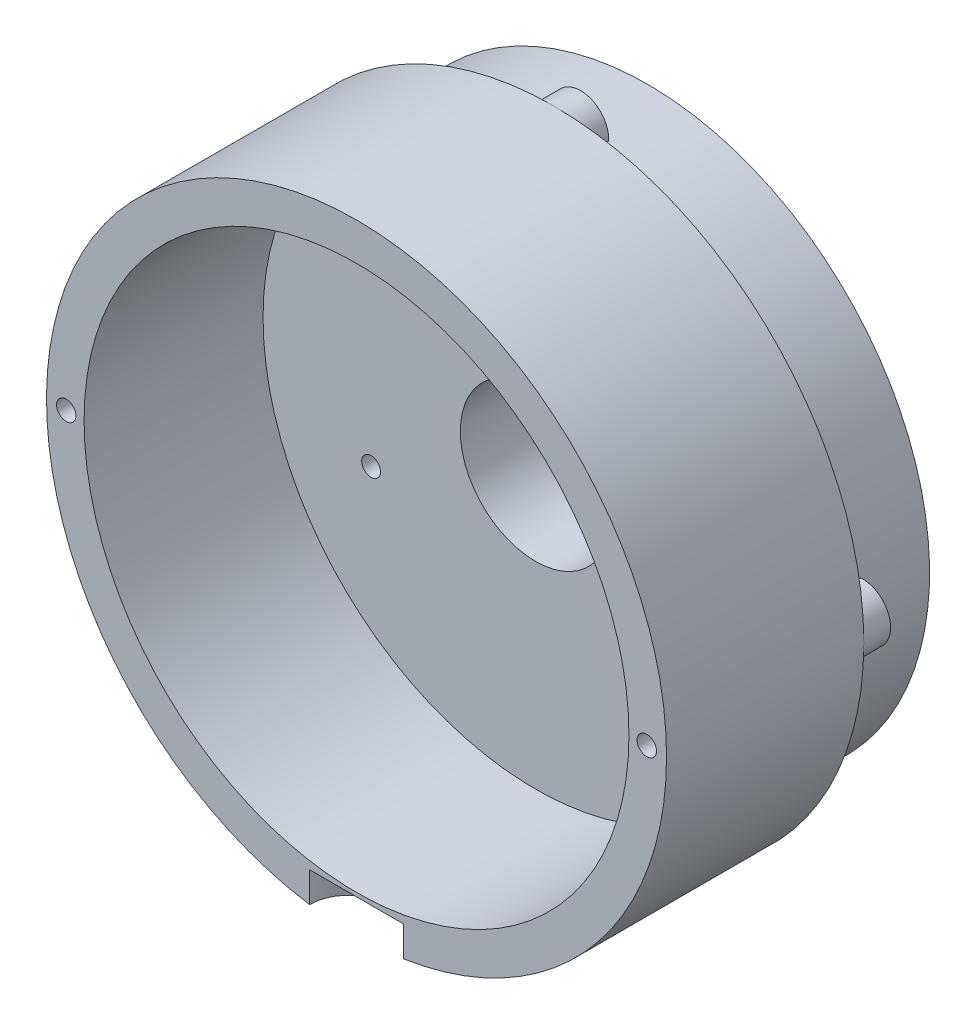
ISO-10303-21;
HEADER;
FILE_DESCRIPTION(('STEP AP214'),'2;1');
FILE_NAME('part.step','',(''),(''),'','','');
FILE_SCHEMA(('AUTOMOTIVE_DESIGN { 1 0 10303 214 1 1 1 1 }'));
ENDSEC;
DATA;
#1=APPLICATION_CONTEXT('core data for automotive mechanical design processes');
#2=APPLICATION_PROTOCOL_DEFINITION('international standard','automotive_design',2000,#1);
#3=PRODUCT_CONTEXT('',#1,'mechanical');
#4=PRODUCT('Part','Part','',(#3));
#5=PRODUCT_RELATED_PRODUCT_CATEGORY('part','',(#4));
#6=PRODUCT_DEFINITION_FORMATION('','',#4);
#7=PRODUCT_DEFINITION_CONTEXT('part definition',#1,'design');
#8=PRODUCT_DEFINITION('design','',#6,#7);
#9=PRODUCT_DEFINITION_SHAPE('','',#8);
#10=(LENGTH_UNIT() NAMED_UNIT(*) SI_UNIT(.MILLI.,.METRE.));
#11=(NAMED_UNIT(*) PLANE_ANGLE_UNIT() SI_UNIT($,.RADIAN.));
#12=(NAMED_UNIT(*) SI_UNIT($,.STERADIAN.) SOLID_ANGLE_UNIT());
#13=UNCERTAINTY_MEASURE_WITH_UNIT(LENGTH_MEASURE(1.E-05),#10,'distance_accuracy_value','');
#14=(GEOMETRIC_REPRESENTATION_CONTEXT(3) GLOBAL_UNCERTAINTY_ASSIGNED_CONTEXT((#13)) GLOBAL_UNIT_ASSIGNED_CONTEXT((#10,
#11,#12)) REPRESENTATION_CONTEXT('',''));
#15=CARTESIAN_POINT('',(0.,0.,0.));
#16=DIRECTION('',(0.,0.,1.));
#17=DIRECTION('',(1.,0.,0.));
#18=AXIS2_PLACEMENT_3D('',#15,#16,#17);
#19=CARTESIAN_POINT('',(0.,0.,-31.));
#20=DIRECTION('',(0.,0.,1.));
#21=DIRECTION('',(1.,0.,0.));
#22=AXIS2_PLACEMENT_3D('',#19,#20,#21);
#23=CYLINDRICAL_SURFACE('',#22,30.);
#24=CARTESIAN_POINT('',(0.,0.,-31.));
#25=DIRECTION('',(0.,0.,-1.));
#26=DIRECTION('',(-1.,0.,0.));
#27=AXIS2_PLACEMENT_3D('',#24,#25,#26);
#28=CIRCLE('',#27,30.);
#29=CARTESIAN_POINT('',(-30.,0.,-31.));
#30=VERTEX_POINT('',#29);
#31=EDGE_CURVE('E666',#30,#30,#28,.T.);
#32=ORIENTED_EDGE('',*,*,#31,.F.);
#33=EDGE_LOOP('',(#32));
#34=FACE_BOUND('',#33,.T.);
#35=DIRECTION('',(0.,0.,1.));
#36=VECTOR('',#35,1.);
#37=CARTESIAN_POINT('',(2.99624765331606,-29.85,-23.85));
#38=LINE('',#37,#36);
#39=CARTESIAN_POINT('',(2.99624765331606,-29.85,-23.85));
#40=VERTEX_POINT('',#39);
#41=CARTESIAN_POINT('',(2.99624765331608,-29.85,-21.));
#42=VERTEX_POINT('',#41);
#43=EDGE_CURVE('E608',#40,#42,#38,.T.);
#44=ORIENTED_EDGE('',*,*,#43,.F.);
#45=CARTESIAN_POINT('',(0.,0.,-23.85));
#46=DIRECTION('',(0.,0.,1.));
#47=DIRECTION('',(-1.,0.,0.));
#48=AXIS2_PLACEMENT_3D('',#45,#46,#47);
#49=CIRCLE('',#48,30.);
#50=CARTESIAN_POINT('',(-2.99624765331544,-29.85,-23.85));
#51=VERTEX_POINT('',#50);
#52=EDGE_CURVE('E62',#51,#40,#49,.T.);
#53=ORIENTED_EDGE('',*,*,#52,.F.);
#54=DIRECTION('',(0.,0.,1.));
#55=VECTOR('',#54,1.);
#56=CARTESIAN_POINT('',(-2.99624765331544,-29.85,-23.85));
#57=LINE('',#56,#55);
#58=CARTESIAN_POINT('',(-2.99624765331546,-29.85,-21.));
#59=VERTEX_POINT('',#58);
#60=EDGE_CURVE('E618',#51,#59,#57,.T.);
#61=ORIENTED_EDGE('',*,*,#60,.T.);
#62=CARTESIAN_POINT('',(0.,0.,-21.));
#63=DIRECTION('',(0.,0.,-1.));
#64=DIRECTION('',(-1.,0.,0.));
#65=AXIS2_PLACEMENT_3D('',#62,#63,#64);
#66=CIRCLE('',#65,30.);
#67=CARTESIAN_POINT('',(-29.85,-2.99624765331598,-21.));
#68=VERTEX_POINT('',#67);
#69=EDGE_CURVE('E602',#59,#68,#66,.T.);
#70=ORIENTED_EDGE('',*,*,#69,.T.);
#71=DIRECTION('',(0.,0.,1.));
#72=VECTOR('',#71,1.);
#73=CARTESIAN_POINT('',(-29.85,-2.99624765331596,-23.85));
#74=LINE('',#73,#72);
#75=CARTESIAN_POINT('',(-29.85,-2.99624765331596,-23.85));
#76=VERTEX_POINT('',#75);
#77=EDGE_CURVE('E612',#76,#68,#74,.T.);
#78=ORIENTED_EDGE('',*,*,#77,.F.);
#79=CARTESIAN_POINT('',(0.,0.,-23.85));
#80=DIRECTION('',(0.,0.,1.));
#81=DIRECTION('',(-1.,0.,0.));
#82=AXIS2_PLACEMENT_3D('',#79,#80,#81);
#83=CIRCLE('',#82,30.);
#84=CARTESIAN_POINT('',(-29.85,2.99624765331554,-23.85));
#85=VERTEX_POINT('',#84);
#86=EDGE_CURVE('E633',#85,#76,#83,.T.);
#87=ORIENTED_EDGE('',*,*,#86,.F.);
#88=DIRECTION('',(0.,0.,1.));
#89=VECTOR('',#88,1.);
#90=CARTESIAN_POINT('',(-29.85,2.99624765331554,-23.85));
#91=LINE('',#90,#89);
#92=CARTESIAN_POINT('',(-29.85,2.99624765331554,-21.));
#93=VERTEX_POINT('',#92);
#94=EDGE_CURVE('E614',#85,#93,#91,.T.);
#95=ORIENTED_EDGE('',*,*,#94,.T.);
#96=CARTESIAN_POINT('',(-2.99624765331587,29.85,-21.));
#97=VERTEX_POINT('',#96);
#98=EDGE_CURVE('E688',#93,#97,#66,.T.);
#99=ORIENTED_EDGE('',*,*,#98,.T.);
#100=DIRECTION('',(0.,0.,1.));
#101=VECTOR('',#100,1.);
#102=CARTESIAN_POINT('',(-2.99624765331585,29.85,-23.85));
#103=LINE('',#102,#101);
#104=CARTESIAN_POINT('',(-2.99624765331585,29.85,-23.85));
#105=VERTEX_POINT('',#104);
#106=EDGE_CURVE('E629',#105,#97,#103,.T.);
#107=ORIENTED_EDGE('',*,*,#106,.F.);
#108=CARTESIAN_POINT('',(0.,0.,-23.85));
#109=DIRECTION('',(0.,0.,1.));
#110=DIRECTION('',(-1.,0.,0.));
#111=AXIS2_PLACEMENT_3D('',#108,#109,#110);
#112=CIRCLE('',#111,30.);
#113=CARTESIAN_POINT('',(2.99624765331564,29.85,-23.85));
#114=VERTEX_POINT('',#113);
#115=EDGE_CURVE('E646',#114,#105,#112,.T.);
#116=ORIENTED_EDGE('',*,*,#115,.F.);
#117=DIRECTION('',(0.,0.,1.));
#118=VECTOR('',#117,1.);
#119=CARTESIAN_POINT('',(2.99624765331565,29.85,-23.85));
#120=LINE('',#119,#118);
#121=CARTESIAN_POINT('',(2.99624765331565,29.85,-21.));
#122=VERTEX_POINT('',#121);
#123=EDGE_CURVE('E638',#114,#122,#120,.T.);
#124=ORIENTED_EDGE('',*,*,#123,.T.);
#125=CARTESIAN_POINT('',(29.85,2.99624765331575,-21.));
#126=VERTEX_POINT('',#125);
#127=EDGE_CURVE('E671',#122,#126,#66,.T.);
#128=ORIENTED_EDGE('',*,*,#127,.T.);
#129=DIRECTION('',(0.,0.,1.));
#130=VECTOR('',#129,1.);
#131=CARTESIAN_POINT('',(29.85,2.99624765331575,-23.85));
#132=LINE('',#131,#130);
#133=CARTESIAN_POINT('',(29.85,2.99624765331575,-23.85));
#134=VERTEX_POINT('',#133);
#135=EDGE_CURVE('E663',#134,#126,#132,.T.);
#136=ORIENTED_EDGE('',*,*,#135,.F.);
#137=CARTESIAN_POINT('',(0.,0.,-23.85));
#138=DIRECTION('',(0.,0.,1.));
#139=DIRECTION('',(-1.,0.,0.));
#140=AXIS2_PLACEMENT_3D('',#137,#138,#139);
#141=CIRCLE('',#140,30.);
#142=CARTESIAN_POINT('',(29.85,-2.99624765331575,-23.85));
#143=VERTEX_POINT('',#142);
#144=EDGE_CURVE('E651',#143,#134,#141,.T.);
#145=ORIENTED_EDGE('',*,*,#144,.F.);
#146=DIRECTION('',(0.,0.,1.));
#147=VECTOR('',#146,1.);
#148=CARTESIAN_POINT('',(29.85,-2.99624765331575,-23.85));
#149=LINE('',#148,#147);
#150=CARTESIAN_POINT('',(29.85,-2.99624765331575,-21.));
#151=VERTEX_POINT('',#150);
#152=EDGE_CURVE('E658',#143,#151,#149,.T.);
#153=ORIENTED_EDGE('',*,*,#152,.T.);
#154=EDGE_CURVE('E48',#151,#42,#66,.T.);
#155=ORIENTED_EDGE('',*,*,#154,.T.);
#156=EDGE_LOOP('',(#44,#53,#61,#70,#78,#87,#95,#99,#107,#116,#124,#128,#136,#145,#153,#155));
#157=FACE_BOUND('',#156,.T.);
#158=ADVANCED_FACE('F39',(#34,#157),#23,.T.);
#159=CARTESIAN_POINT('',(0.,0.,-21.));
#160=DIRECTION('',(0.,0.,1.));
#161=DIRECTION('',(1.,0.,0.));
#162=AXIS2_PLACEMENT_3D('',#159,#160,#161);
#163=PLANE('',#162);
#164=CARTESIAN_POINT('',(3.14233320495882E-13,-30.,-21.));
#165=DIRECTION('',(0.,0.,-1.));
#166=DIRECTION('',(-1.,0.,0.));
#167=AXIS2_PLACEMENT_3D('',#164,#165,#166);
#168=CIRCLE('',#167,3.00000000000002);
#169=CARTESIAN_POINT('',(3.4565665254547E-13,-33.,-21.));
#170=VERTEX_POINT('',#169);
#171=EDGE_CURVE('E597',#170,#59,#168,.T.);
#172=ORIENTED_EDGE('',*,*,#171,.F.);
#173=CARTESIAN_POINT('',(0.,0.,-21.));
#174=DIRECTION('',(0.,0.,1.));
#175=DIRECTION('',(1.,0.,0.));
#176=AXIS2_PLACEMENT_3D('',#173,#174,#175);
#177=CIRCLE('',#176,33.);
#178=CARTESIAN_POINT('',(-33.,-2.30437768363647E-13,-21.));
#179=VERTEX_POINT('',#178);
#180=EDGE_CURVE('E600',#179,#170,#177,.T.);
#181=ORIENTED_EDGE('',*,*,#180,.F.);
#182=CARTESIAN_POINT('',(-30.,-2.09488880330588E-13,-21.));
#183=DIRECTION('',(0.,0.,-1.));
#184=DIRECTION('',(-1.,0.,0.));
#185=AXIS2_PLACEMENT_3D('',#182,#183,#184);
#186=CIRCLE('',#185,3.00000000000002);
#187=EDGE_CURVE('E626',#68,#179,#186,.T.);
#188=ORIENTED_EDGE('',*,*,#187,.F.);
#189=ORIENTED_EDGE('',*,*,#69,.F.);
#190=EDGE_LOOP('',(#172,#181,#188,#189));
#191=FACE_BOUND('',#190,.T.);
#192=ADVANCED_FACE('F234',(#191),#163,.F.);
#193=EDGE_CURVE('E604',#42,#170,#168,.T.);
#194=ORIENTED_EDGE('',*,*,#193,.F.);
#195=ORIENTED_EDGE('',*,*,#154,.F.);
#196=CARTESIAN_POINT('',(30.,0.,-21.));
#197=DIRECTION('',(0.,0.,-1.));
#198=DIRECTION('',(-1.,0.,0.));
#199=AXIS2_PLACEMENT_3D('',#196,#197,#198);
#200=CIRCLE('',#199,3.00000000000002);
#201=CARTESIAN_POINT('',(33.,0.,-21.));
#202=VERTEX_POINT('',#201);
#203=EDGE_CURVE('E645',#202,#151,#200,.T.);
#204=ORIENTED_EDGE('',*,*,#203,.F.);
#205=EDGE_CURVE('E680',#170,#202,#177,.T.);
#206=ORIENTED_EDGE('',*,*,#205,.F.);
#207=EDGE_LOOP('',(#194,#195,#204,#206));
#208=FACE_BOUND('',#207,.T.);
#209=ADVANCED_FACE('F436',(#208),#163,.F.);
#210=EDGE_CURVE('E630',#179,#93,#186,.T.);
#211=ORIENTED_EDGE('',*,*,#210,.F.);
#212=CARTESIAN_POINT('',(-1.15218884181823E-13,33.,-21.));
#213=VERTEX_POINT('',#212);
#214=EDGE_CURVE('E679',#213,#179,#177,.T.);
#215=ORIENTED_EDGE('',*,*,#214,.F.);
#216=CARTESIAN_POINT('',(-1.04744440165294E-13,30.,-21.));
#217=DIRECTION('',(0.,0.,-1.));
#218=DIRECTION('',(-1.,0.,0.));
#219=AXIS2_PLACEMENT_3D('',#216,#217,#218);
#220=CIRCLE('',#219,3.00000000000002);
#221=EDGE_CURVE('E642',#97,#213,#220,.T.);
#222=ORIENTED_EDGE('',*,*,#221,.F.);
#223=ORIENTED_EDGE('',*,*,#98,.F.);
#224=EDGE_LOOP('',(#211,#215,#222,#223));
#225=FACE_BOUND('',#224,.T.);
#226=ADVANCED_FACE('F246',(#225),#163,.F.);
#227=CARTESIAN_POINT('',(0.,0.,-21.));
#228=DIRECTION('',(0.,0.,1.));
#229=DIRECTION('',(1.,0.,0.));
#230=AXIS2_PLACEMENT_3D('',#227,#228,#229);
#231=CYLINDRICAL_SURFACE('',#230,33.);
#232=CARTESIAN_POINT('',(-5.,-32.6190128606002,0.));
#233=CARTESIAN_POINT('',(-5.00001601020323,-32.6190035828036,-0.139767168316412));
#234=CARTESIAN_POINT('',(-4.99414023076228,-32.6199108647252,-0.279530949472853));
#235=CARTESIAN_POINT('',(-4.97072156401182,-32.6234913261665,-0.558042581063598));
#236=CARTESIAN_POINT('',(-4.95317973713174,-32.6261643451827,-0.696790522677648));
#237=CARTESIAN_POINT('',(-4.90657275631915,-32.6332049503196,-0.972125522905081));
#238=CARTESIAN_POINT('',(-4.87752114214626,-32.6375705452176,-1.10871492513022));
#239=CARTESIAN_POINT('',(-4.80811872926188,-32.6478671900791,-1.3789306045644));
#240=CARTESIAN_POINT('',(-4.76776796420062,-32.6537982353805,-1.51255689059668));
#241=CARTESIAN_POINT('',(-4.67606282638854,-32.6670564742613,-1.77591691938822));
#242=CARTESIAN_POINT('',(-4.6247076885632,-32.6743837649102,-1.90565039078581));
#243=CARTESIAN_POINT('',(-4.51135028346583,-32.6902277977168,-2.16036052095221));
#244=CARTESIAN_POINT('',(-4.44934408241917,-32.698744979121,-2.28533540131443));
#245=CARTESIAN_POINT('',(-4.31516996042624,-32.7167217974423,-2.5295678786847));
#246=CARTESIAN_POINT('',(-4.2430061457105,-32.7261810530746,-2.6488277600038));
#247=CARTESIAN_POINT('',(-4.08897812396379,-32.7457827034096,-2.88091347560192));
#248=CARTESIAN_POINT('',(-4.00711031549556,-32.7559253511327,-2.99373689796603));
#249=CARTESIAN_POINT('',(-3.83367296649378,-32.7766781210404,-3.21288202284274));
#250=CARTESIAN_POINT('',(-3.74204096143706,-32.7872909637268,-3.31915403608859));
#251=CARTESIAN_POINT('',(-3.55014304390875,-32.8086239428629,-3.52365623710888));
#252=CARTESIAN_POINT('',(-3.44987394858321,-32.8193441175683,-3.62188343405101));
#253=CARTESIAN_POINT('',(-3.2414455563156,-32.8405846311388,-3.8095527181624));
#254=CARTESIAN_POINT('',(-3.1332879539488,-32.8511050123144,-3.89899668247809));
#255=CARTESIAN_POINT('',(-2.90976710785706,-32.8716572966495,-4.06853025645773));
#256=CARTESIAN_POINT('',(-2.79440122137656,-32.8816890182256,-4.14861640403586));
#257=CARTESIAN_POINT('',(-2.55675833739258,-32.9010221727794,-4.29916980162759));
#258=CARTESIAN_POINT('',(-2.43445239953123,-32.9103200916287,-4.36959183382518));
#259=CARTESIAN_POINT('',(-2.18422022475594,-32.9278744704263,-4.49989874865233));
#260=CARTESIAN_POINT('',(-2.05629191441459,-32.9361305417408,-4.55977970248045));
#261=CARTESIAN_POINT('',(-1.79582286413044,-32.951358496512,-4.66850354734549));
#262=CARTESIAN_POINT('',(-1.66328431859749,-32.958330981257,-4.71735160911933));
#263=CARTESIAN_POINT('',(-1.3944407885997,-32.970800039678,-4.80369440352828));
#264=CARTESIAN_POINT('',(-1.25813444947012,-32.9762960746975,-4.8411849932257));
#265=CARTESIAN_POINT('',(-0.983870528206103,-32.9856127463921,-4.90424548517488));
#266=CARTESIAN_POINT('',(-0.84593486765723,-32.989446429551,-4.92990831817986));
#267=CARTESIAN_POINT('',(-0.568364258929378,-32.9953984822913,-4.96957439633096));
#268=CARTESIAN_POINT('',(-0.428728737246001,-32.997516255704,-4.98357358915809));
#269=CARTESIAN_POINT('',(-0.0087803796854928,-33.0011776878662,-5.00781969659953));
#270=CARTESIAN_POINT('',(0.272880925578491,-33.0000401146603,-5.00038548576204));
#271=CARTESIAN_POINT('',(0.689771801664072,-32.9930842248025,-4.95415987603519));
#272=CARTESIAN_POINT('',(0.827315033678111,-32.9899114811567,-4.93304435121594));
#273=CARTESIAN_POINT('',(1.10012451959802,-32.9819384006462,-4.87944650495612));
#274=CARTESIAN_POINT('',(1.235391547641,-32.9771386293769,-4.84696813339984));
#275=CARTESIAN_POINT('',(1.50272753510958,-32.9660392127504,-4.77086446561458));
#276=CARTESIAN_POINT('',(1.63479531686574,-32.9597390240496,-4.72723513088654));
#277=CARTESIAN_POINT('',(1.89473519646658,-32.9458177550404,-4.62917520434625));
#278=CARTESIAN_POINT('',(2.02260876673376,-32.9381971443128,-4.57474845141849));
#279=CARTESIAN_POINT('',(2.27385537618176,-32.9218089002243,-4.45522365410155));
#280=CARTESIAN_POINT('',(2.3972071010094,-32.9130365534308,-4.3900814639814));
#281=CARTESIAN_POINT('',(2.63794736518501,-32.8946166451339,-4.24978077474453));
#282=CARTESIAN_POINT('',(2.75533801853808,-32.8849693973306,-4.17462586124074));
#283=CARTESIAN_POINT('',(2.98344672487643,-32.8650598780903,-4.01477885898509));
#284=CARTESIAN_POINT('',(3.09416223120415,-32.854797374866,-3.93008316520545));
#285=CARTESIAN_POINT('',(3.30808169306138,-32.8339480290047,-3.75179634026021));
#286=CARTESIAN_POINT('',(3.41128831997988,-32.8233613036377,-3.65820840023055));
#287=CARTESIAN_POINT('',(3.61055424830731,-32.8020432897885,-3.46174447816719));
#288=CARTESIAN_POINT('',(3.70652905660725,-32.7913116348693,-3.35878281641981));
#289=CARTESIAN_POINT('',(3.8894386194533,-32.7701196724516,-3.14516022351662));
#290=CARTESIAN_POINT('',(3.97637665014609,-32.7596592676548,-3.03450210704915));
#291=CARTESIAN_POINT('',(4.14069611535747,-32.7392959127616,-2.80614252586511));
#292=CARTESIAN_POINT('',(4.21807114370907,-32.7293933387418,-2.68843641728553));
#293=CARTESIAN_POINT('',(4.36261657477498,-32.7104400831003,-2.44691150479264));
#294=CARTESIAN_POINT('',(4.42979081416874,-32.7013890816783,-2.32309502242059));
#295=CARTESIAN_POINT('',(4.55359149681402,-32.6843803354967,-2.06994974368347));
#296=CARTESIAN_POINT('',(4.61019899824366,-32.6764245606024,-1.94061154937197));
#297=CARTESIAN_POINT('',(4.71227813733427,-32.6618599291047,-1.67759519710639));
#298=CARTESIAN_POINT('',(4.75775405347049,-32.6552505551703,-1.54391872903271));
#299=CARTESIAN_POINT('',(4.83721185184773,-32.6435750795525,-1.27328365891392));
#300=CARTESIAN_POINT('',(4.87120590986088,-32.6385073436315,-1.13632869964392));
#301=CARTESIAN_POINT('',(4.92749352054901,-32.6300569846447,-0.860040374803553));
#302=CARTESIAN_POINT('',(4.94979270871416,-32.6266735499927,-0.72070818824858));
#303=CARTESIAN_POINT('',(4.97744045804998,-32.6224649007544,-0.484266938509058));
#304=CARTESIAN_POINT('',(4.98590498972544,-32.621171163183,-0.387519128260159));
#305=CARTESIAN_POINT('',(4.99718116376625,-32.6194449519462,-0.193850687134879));
#306=CARTESIAN_POINT('',(5.0000023087137,-32.6190110304963,-0.0969306222827842));
#307=CARTESIAN_POINT('',(5.,-32.6190128606002,0.));
#308=B_SPLINE_CURVE_WITH_KNOTS('',3,(#232,#233,#234,#235,#236,#237,#238,#239,#240,#241,#242,
#243,#244,#245,#246,#247,#248,#249,#250,#251,#252,#253,#254,#255,#256,#257,#258,#259,#260,#261,
#262,#263,#264,#265,#266,#267,#268,#269,#270,#271,#272,#273,#274,#275,#276,#277,#278,#279,#280,
#281,#282,#283,#284,#285,#286,#287,#288,#289,#290,#291,#292,#293,#294,#295,#296,#297,#298,#299,
#300,#301,#302,#303,#304,#305,#306,#307),.UNSPECIFIED.,.F.,.F.,(4,2,2,2,2,2,2,2,2,2,2,2,2,2,2,2,
2,2,2,2,2,2,2,2,2,2,2,2,2,2,2,2,2,2,2,2,2,4),(0.,0.419170102117368,0.838302107392148,
1.25694251574136,1.67558167734276,2.09424995411039,2.5130731920964,2.93172760383453,
3.35053787989946,3.77220964196175,4.19403746454652,4.6157749372695,5.03766794830537,
5.46147216609385,5.88543400849631,6.30919674035698,6.73311386524237,7.15364097676925,
7.57431413191477,8.41472750218509,8.83193072486811,9.24898906574129,9.66619866550322,
10.0832601966901,10.5020850821021,10.9207603850855,11.3395944204925,11.7582787137323,
12.181272134873,12.6041116673557,13.0272329382704,13.4501946702459,13.8739074668372,
14.2974571508726,14.7205562671155,15.1434513138091,15.4346711109229,15.7254001252013),.UNSPECIFIED.);
#309=CARTESIAN_POINT('',(-5.,-32.6190128606002,0.));
#310=VERTEX_POINT('',#309);
#311=CARTESIAN_POINT('',(5.,-32.6190128606002,0.));
#312=VERTEX_POINT('',#311);
#313=EDGE_CURVE('E145',#310,#312,#308,.T.);
#314=ORIENTED_EDGE('',*,*,#313,.F.);
#315=CARTESIAN_POINT('',(0.,0.,0.));
#316=DIRECTION('',(0.,0.,1.));
#317=DIRECTION('',(1.,0.,0.));
#318=AXIS2_PLACEMENT_3D('',#315,#316,#317);
#319=CIRCLE('',#318,33.);
#320=EDGE_CURVE('E144',#312,#310,#319,.T.);
#321=ORIENTED_EDGE('',*,*,#320,.F.);
#322=EDGE_LOOP('',(#314,#321));
#323=FACE_BOUND('',#322,.T.);
#324=EDGE_CURVE('E677',#202,#213,#177,.T.);
#325=ORIENTED_EDGE('',*,*,#324,.T.);
#326=ORIENTED_EDGE('',*,*,#214,.T.);
#327=ORIENTED_EDGE('',*,*,#180,.T.);
#328=ORIENTED_EDGE('',*,*,#205,.T.);
#329=EDGE_LOOP('',(#325,#326,#327,#328));
#330=FACE_BOUND('',#329,.T.);
#331=ADVANCED_FACE('F41',(#323,#330),#231,.T.);
#332=CARTESIAN_POINT('',(-1.04744440165294E-13,30.,-21.));
#333=DIRECTION('',(0.,0.,1.));
#334=DIRECTION('',(1.,0.,0.));
#335=AXIS2_PLACEMENT_3D('',#332,#333,#334);
#336=CIRCLE('',#335,3.00000000000002);
#337=EDGE_CURVE('E11',#213,#122,#336,.F.);
#338=ORIENTED_EDGE('',*,*,#337,.F.);
#339=ORIENTED_EDGE('',*,*,#324,.F.);
#340=EDGE_CURVE('E655',#126,#202,#200,.T.);
#341=ORIENTED_EDGE('',*,*,#340,.F.);
#342=ORIENTED_EDGE('',*,*,#127,.F.);
#343=EDGE_LOOP('',(#338,#339,#341,#342));
#344=FACE_BOUND('',#343,.T.);
#345=ADVANCED_FACE('F243',(#344),#163,.F.);
#346=CARTESIAN_POINT('',(0.,0.,0.));
#347=DIRECTION('',(0.,0.,1.));
#348=DIRECTION('',(1.,0.,0.));
#349=AXIS2_PLACEMENT_3D('',#346,#347,#348);
#350=PLANE('',#349);
#351=DIRECTION('',(0.,-1.,0.));
#352=VECTOR('',#351,1.);
#353=CARTESIAN_POINT('',(-5.,-29.4,0.));
#354=LINE('',#353,#352);
#355=CARTESIAN_POINT('',(-5.,-29.4,0.));
#356=VERTEX_POINT('',#355);
#357=EDGE_CURVE('E129',#356,#310,#354,.T.);
#358=ORIENTED_EDGE('',*,*,#357,.F.);
#359=DIRECTION('',(-1.,0.,0.));
#360=VECTOR('',#359,1.);
#361=CARTESIAN_POINT('',(5.,-29.4,0.));
#362=LINE('',#361,#360);
#363=CARTESIAN_POINT('',(5.,-29.4,0.));
#364=VERTEX_POINT('',#363);
#365=EDGE_CURVE('E134',#364,#356,#362,.T.);
#366=ORIENTED_EDGE('',*,*,#365,.F.);
#367=DIRECTION('',(0.,-1.,0.));
#368=VECTOR('',#367,1.);
#369=CARTESIAN_POINT('',(5.,-29.4,0.));
#370=LINE('',#369,#368);
#371=EDGE_CURVE('E132',#364,#312,#370,.T.);
#372=ORIENTED_EDGE('',*,*,#371,.T.);
#373=ORIENTED_EDGE('',*,*,#320,.T.);
#374=EDGE_LOOP('',(#358,#366,#372,#373));
#375=FACE_BOUND('',#374,.T.);
#376=CARTESIAN_POINT('',(-30.9,0.,0.));
#377=DIRECTION('',(0.,0.,1.));
#378=DIRECTION('',(1.,0.,0.));
#379=AXIS2_PLACEMENT_3D('',#376,#377,#378);
#380=CIRCLE('',#379,1.0325);
#381=CARTESIAN_POINT('',(-29.8675,0.,0.));
#382=VERTEX_POINT('',#381);
#383=EDGE_CURVE('E718',#382,#382,#380,.T.);
#384=ORIENTED_EDGE('',*,*,#383,.F.);
#385=EDGE_LOOP('',(#384));
#386=FACE_BOUND('',#385,.T.);
#387=CARTESIAN_POINT('',(30.9,0.,0.));
#388=DIRECTION('',(0.,0.,1.));
#389=DIRECTION('',(-1.,0.,0.));
#390=AXIS2_PLACEMENT_3D('',#387,#388,#389);
#391=CIRCLE('',#390,1.0325);
#392=CARTESIAN_POINT('',(29.8675,0.,0.));
#393=VERTEX_POINT('',#392);
#394=EDGE_CURVE('E716',#393,#393,#391,.T.);
#395=ORIENTED_EDGE('',*,*,#394,.F.);
#396=EDGE_LOOP('',(#395));
#397=FACE_BOUND('',#396,.T.);
#398=CARTESIAN_POINT('',(0.,0.,0.));
#399=DIRECTION('',(0.,0.,1.));
#400=DIRECTION('',(1.,0.,0.));
#401=AXIS2_PLACEMENT_3D('',#398,#399,#400);
#402=CIRCLE('',#401,29.);
#403=CARTESIAN_POINT('',(29.,0.,0.));
#404=VERTEX_POINT('',#403);
#405=EDGE_CURVE('E669',#404,#404,#402,.T.);
#406=ORIENTED_EDGE('',*,*,#405,.F.);
#407=EDGE_LOOP('',(#406));
#408=FACE_BOUND('',#407,.T.);
#409=ADVANCED_FACE('F141',(#375,#386,#397,#408),#350,.T.);
#410=CARTESIAN_POINT('',(0.,0.,-19.05));
#411=DIRECTION('',(0.,0.,1.));
#412=DIRECTION('',(1.,0.,0.));
#413=AXIS2_PLACEMENT_3D('',#410,#411,#412);
#414=CYLINDRICAL_SURFACE('',#413,29.);
#415=CARTESIAN_POINT('',(0.,0.,-19.05));
#416=DIRECTION('',(0.,0.,1.));
#417=DIRECTION('',(1.,0.,0.));
#418=AXIS2_PLACEMENT_3D('',#415,#416,#417);
#419=CIRCLE('',#418,29.);
#420=CARTESIAN_POINT('',(29.,0.,-19.05));
#421=VERTEX_POINT('',#420);
#422=EDGE_CURVE('E672',#421,#421,#419,.T.);
#423=ORIENTED_EDGE('',*,*,#422,.F.);
#424=EDGE_LOOP('',(#423));
#425=FACE_BOUND('',#424,.T.);
#426=ORIENTED_EDGE('',*,*,#405,.T.);
#427=EDGE_LOOP('',(#426));
#428=FACE_BOUND('',#427,.T.);
#429=ADVANCED_FACE('F238',(#425,#428),#414,.F.);
#430=CARTESIAN_POINT('',(0.,0.,-19.05));
#431=DIRECTION('',(0.,0.,1.));
#432=DIRECTION('',(1.,0.,0.));
#433=AXIS2_PLACEMENT_3D('',#430,#431,#432);
#434=PLANE('',#433);
#435=CARTESIAN_POINT('',(17.5,-8.,-19.05));
#436=DIRECTION('',(0.,0.,1.));
#437=DIRECTION('',(1.,0.,0.));
#438=AXIS2_PLACEMENT_3D('',#435,#436,#437);
#439=CIRCLE('',#438,1.);
#440=CARTESIAN_POINT('',(18.5,-8.,-19.05));
#441=VERTEX_POINT('',#440);
#442=EDGE_CURVE('E750',#441,#441,#439,.T.);
#443=ORIENTED_EDGE('',*,*,#442,.F.);
#444=EDGE_LOOP('',(#443));
#445=FACE_BOUND('',#444,.T.);
#446=CARTESIAN_POINT('',(-17.5,-8.,-19.05));
#447=DIRECTION('',(0.,0.,1.));
#448=DIRECTION('',(-1.,0.,0.));
#449=AXIS2_PLACEMENT_3D('',#446,#447,#448);
#450=CIRCLE('',#449,1.);
#451=CARTESIAN_POINT('',(-18.5,-8.,-19.05));
#452=VERTEX_POINT('',#451);
#453=EDGE_CURVE('E753',#452,#452,#450,.T.);
#454=ORIENTED_EDGE('',*,*,#453,.F.);
#455=EDGE_LOOP('',(#454));
#456=FACE_BOUND('',#455,.T.);
#457=CARTESIAN_POINT('',(0.,15.,-19.05));
#458=DIRECTION('',(0.,0.,1.));
#459=DIRECTION('',(1.,0.,0.));
#460=AXIS2_PLACEMENT_3D('',#457,#458,#459);
#461=CIRCLE('',#460,4.1);
#462=CARTESIAN_POINT('',(4.1,15.,-19.05));
#463=VERTEX_POINT('',#462);
#464=EDGE_CURVE('E703',#463,#463,#461,.T.);
#465=ORIENTED_EDGE('',*,*,#464,.F.);
#466=EDGE_LOOP('',(#465));
#467=FACE_BOUND('',#466,.T.);
#468=CARTESIAN_POINT('',(0.,0.,-19.05));
#469=DIRECTION('',(0.,0.,1.));
#470=DIRECTION('',(1.,0.,0.));
#471=AXIS2_PLACEMENT_3D('',#468,#469,#470);
#472=CIRCLE('',#471,8.);
#473=CARTESIAN_POINT('',(8.,0.,-19.05));
#474=VERTEX_POINT('',#473);
#475=EDGE_CURVE('E695',#474,#474,#472,.T.);
#476=ORIENTED_EDGE('',*,*,#475,.F.);
#477=EDGE_LOOP('',(#476));
#478=FACE_BOUND('',#477,.T.);
#479=ORIENTED_EDGE('',*,*,#422,.T.);
#480=EDGE_LOOP('',(#479));
#481=FACE_BOUND('',#480,.T.);
#482=ADVANCED_FACE('F230',(#445,#456,#467,#478,#481),#434,.T.);
#483=CARTESIAN_POINT('',(0.,0.,-31.));
#484=DIRECTION('',(0.,0.,-1.));
#485=DIRECTION('',(-1.,0.,0.));
#486=AXIS2_PLACEMENT_3D('',#483,#484,#485);
#487=PLANE('',#486);
#488=CARTESIAN_POINT('',(0.,15.,-31.));
#489=DIRECTION('',(0.,0.,-1.));
#490=DIRECTION('',(-1.,0.,0.));
#491=AXIS2_PLACEMENT_3D('',#488,#489,#490);
#492=CIRCLE('',#491,3.);
#493=CARTESIAN_POINT('',(-3.,15.,-31.));
#494=VERTEX_POINT('',#493);
#495=EDGE_CURVE('E711',#494,#494,#492,.T.);
#496=ORIENTED_EDGE('',*,*,#495,.F.);
#497=EDGE_LOOP('',(#496));
#498=FACE_BOUND('',#497,.T.);
#499=CARTESIAN_POINT('',(0.,0.,-31.));
#500=DIRECTION('',(0.,0.,-1.));
#501=DIRECTION('',(-1.,0.,0.));
#502=AXIS2_PLACEMENT_3D('',#499,#500,#501);
#503=CIRCLE('',#502,8.);
#504=CARTESIAN_POINT('',(-8.,0.,-31.));
#505=VERTEX_POINT('',#504);
#506=EDGE_CURVE('E697',#505,#505,#503,.T.);
#507=ORIENTED_EDGE('',*,*,#506,.F.);
#508=EDGE_LOOP('',(#507));
#509=FACE_BOUND('',#508,.T.);
#510=ORIENTED_EDGE('',*,*,#31,.T.);
#511=EDGE_LOOP('',(#510));
#512=FACE_BOUND('',#511,.T.);
#513=ADVANCED_FACE('F226',(#498,#509,#512),#487,.T.);
#514=CARTESIAN_POINT('',(30.,0.,-23.85));
#515=DIRECTION('',(0.,0.,1.));
#516=DIRECTION('',(1.,0.,0.));
#517=AXIS2_PLACEMENT_3D('',#514,#515,#516);
#518=CYLINDRICAL_SURFACE('',#517,3.00000000000002);
#519=ORIENTED_EDGE('',*,*,#340,.T.);
#520=ORIENTED_EDGE('',*,*,#203,.T.);
#521=ORIENTED_EDGE('',*,*,#152,.F.);
#522=CARTESIAN_POINT('',(30.,0.,-23.85));
#523=DIRECTION('',(0.,0.,-1.));
#524=DIRECTION('',(-1.,0.,0.));
#525=AXIS2_PLACEMENT_3D('',#522,#523,#524);
#526=CIRCLE('',#525,3.00000000000002);
#527=EDGE_CURVE('E654',#134,#143,#526,.T.);
#528=ORIENTED_EDGE('',*,*,#527,.F.);
#529=ORIENTED_EDGE('',*,*,#135,.T.);
#530=EDGE_LOOP('',(#519,#520,#521,#528,#529));
#531=FACE_BOUND('',#530,.T.);
#532=ADVANCED_FACE('F222',(#531),#518,.T.);
#533=CARTESIAN_POINT('',(15.,0.,-23.85));
#534=DIRECTION('',(0.,0.,-1.));
#535=DIRECTION('',(-1.,0.,0.));
#536=AXIS2_PLACEMENT_3D('',#533,#534,#535);
#537=PLANE('',#536);
#538=ORIENTED_EDGE('',*,*,#144,.T.);
#539=ORIENTED_EDGE('',*,*,#527,.T.);
#540=EDGE_LOOP('',(#538,#539));
#541=FACE_BOUND('',#540,.T.);
#542=ADVANCED_FACE('F215',(#541),#537,.T.);
#543=CARTESIAN_POINT('',(-1.04744440165294E-13,30.,-23.85));
#544=DIRECTION('',(0.,0.,1.));
#545=DIRECTION('',(1.,0.,0.));
#546=AXIS2_PLACEMENT_3D('',#543,#544,#545);
#547=CYLINDRICAL_SURFACE('',#546,3.00000000000002);
#548=ORIENTED_EDGE('',*,*,#221,.T.);
#549=ORIENTED_EDGE('',*,*,#337,.T.);
#550=ORIENTED_EDGE('',*,*,#123,.F.);
#551=CARTESIAN_POINT('',(-1.04744440165294E-13,30.,-23.85));
#552=DIRECTION('',(0.,0.,-1.));
#553=DIRECTION('',(-1.,0.,0.));
#554=AXIS2_PLACEMENT_3D('',#551,#552,#553);
#555=CIRCLE('',#554,3.00000000000002);
#556=EDGE_CURVE('E641',#105,#114,#555,.T.);
#557=ORIENTED_EDGE('',*,*,#556,.F.);
#558=ORIENTED_EDGE('',*,*,#106,.T.);
#559=EDGE_LOOP('',(#548,#549,#550,#557,#558));
#560=FACE_BOUND('',#559,.T.);
#561=ADVANCED_FACE('F212',(#560),#547,.T.);
#562=CARTESIAN_POINT('',(0.,15.,-23.85));
#563=DIRECTION('',(0.,0.,-1.));
#564=DIRECTION('',(-1.,0.,0.));
#565=AXIS2_PLACEMENT_3D('',#562,#563,#564);
#566=PLANE('',#565);
#567=ORIENTED_EDGE('',*,*,#115,.T.);
#568=ORIENTED_EDGE('',*,*,#556,.T.);
#569=EDGE_LOOP('',(#567,#568));
#570=FACE_BOUND('',#569,.T.);
#571=ADVANCED_FACE('F207',(#570),#566,.T.);
#572=CARTESIAN_POINT('',(-30.,-2.09488880330588E-13,-23.85));
#573=DIRECTION('',(0.,0.,1.));
#574=DIRECTION('',(1.,0.,0.));
#575=AXIS2_PLACEMENT_3D('',#572,#573,#574);
#576=CYLINDRICAL_SURFACE('',#575,3.00000000000002);
#577=ORIENTED_EDGE('',*,*,#187,.T.);
#578=ORIENTED_EDGE('',*,*,#210,.T.);
#579=ORIENTED_EDGE('',*,*,#94,.F.);
#580=CARTESIAN_POINT('',(-30.,-2.09488880330588E-13,-23.85));
#581=DIRECTION('',(0.,0.,-1.));
#582=DIRECTION('',(-1.,0.,0.));
#583=AXIS2_PLACEMENT_3D('',#580,#581,#582);
#584=CIRCLE('',#583,3.00000000000002);
#585=EDGE_CURVE('E625',#76,#85,#584,.T.);
#586=ORIENTED_EDGE('',*,*,#585,.F.);
#587=ORIENTED_EDGE('',*,*,#77,.T.);
#588=EDGE_LOOP('',(#577,#578,#579,#586,#587));
#589=FACE_BOUND('',#588,.T.);
#590=ADVANCED_FACE('F204',(#589),#576,.T.);
#591=CARTESIAN_POINT('',(-15.,-1.04744440165294E-13,-23.85));
#592=DIRECTION('',(0.,0.,-1.));
#593=DIRECTION('',(-1.,0.,0.));
#594=AXIS2_PLACEMENT_3D('',#591,#592,#593);
#595=PLANE('',#594);
#596=ORIENTED_EDGE('',*,*,#86,.T.);
#597=ORIENTED_EDGE('',*,*,#585,.T.);
#598=EDGE_LOOP('',(#596,#597));
#599=FACE_BOUND('',#598,.T.);
#600=ADVANCED_FACE('F199',(#599),#595,.T.);
#601=CARTESIAN_POINT('',(3.14233320495882E-13,-30.,-23.85));
#602=DIRECTION('',(0.,0.,1.));
#603=DIRECTION('',(1.,0.,0.));
#604=AXIS2_PLACEMENT_3D('',#601,#602,#603);
#605=CYLINDRICAL_SURFACE('',#604,3.00000000000002);
#606=ORIENTED_EDGE('',*,*,#193,.T.);
#607=ORIENTED_EDGE('',*,*,#171,.T.);
#608=ORIENTED_EDGE('',*,*,#60,.F.);
#609=CARTESIAN_POINT('',(3.14233320495882E-13,-30.,-23.85));
#610=DIRECTION('',(0.,0.,-1.));
#611=DIRECTION('',(-1.,0.,0.));
#612=AXIS2_PLACEMENT_3D('',#609,#610,#611);
#613=CIRCLE('',#612,3.00000000000002);
#614=EDGE_CURVE('E620',#40,#51,#613,.T.);
#615=ORIENTED_EDGE('',*,*,#614,.F.);
#616=ORIENTED_EDGE('',*,*,#43,.T.);
#617=EDGE_LOOP('',(#606,#607,#608,#615,#616));
#618=FACE_BOUND('',#617,.T.);
#619=ADVANCED_FACE('F196',(#618),#605,.T.);
#620=CARTESIAN_POINT('',(1.57116660247941E-13,-15.,-23.85));
#621=DIRECTION('',(0.,0.,-1.));
#622=DIRECTION('',(-1.,0.,0.));
#623=AXIS2_PLACEMENT_3D('',#620,#621,#622);
#624=PLANE('',#623);
#625=ORIENTED_EDGE('',*,*,#52,.T.);
#626=ORIENTED_EDGE('',*,*,#614,.T.);
#627=EDGE_LOOP('',(#625,#626));
#628=FACE_BOUND('',#627,.T.);
#629=ADVANCED_FACE('F194',(#628),#624,.T.);
#630=CARTESIAN_POINT('',(0.,0.,0.));
#631=DIRECTION('',(0.,0.,-1.));
#632=DIRECTION('',(-1.,0.,0.));
#633=AXIS2_PLACEMENT_3D('',#630,#631,#632);
#634=CYLINDRICAL_SURFACE('',#633,8.);
#635=ORIENTED_EDGE('',*,*,#475,.T.);
#636=EDGE_LOOP('',(#635));
#637=FACE_BOUND('',#636,.T.);
#638=ORIENTED_EDGE('',*,*,#506,.T.);
#639=EDGE_LOOP('',(#638));
#640=FACE_BOUND('',#639,.T.);
#641=ADVANCED_FACE('F187',(#637,#640),#634,.F.);
#642=CARTESIAN_POINT('',(0.,15.,-22.05));
#643=DIRECTION('',(0.,0.,1.));
#644=DIRECTION('',(1.,0.,0.));
#645=AXIS2_PLACEMENT_3D('',#642,#643,#644);
#646=PLANE('',#645);
#647=CARTESIAN_POINT('',(0.,15.,-22.05));
#648=DIRECTION('',(0.,0.,-1.));
#649=DIRECTION('',(-1.,0.,0.));
#650=AXIS2_PLACEMENT_3D('',#647,#648,#649);
#651=CIRCLE('',#650,3.8);
#652=CARTESIAN_POINT('',(-3.8,15.,-22.05));
#653=VERTEX_POINT('',#652);
#654=EDGE_CURVE('E706',#653,#653,#651,.T.);
#655=ORIENTED_EDGE('',*,*,#654,.T.);
#656=EDGE_LOOP('',(#655));
#657=FACE_BOUND('',#656,.T.);
#658=CARTESIAN_POINT('',(0.,15.,-22.05));
#659=DIRECTION('',(0.,0.,1.));
#660=DIRECTION('',(1.,0.,0.));
#661=AXIS2_PLACEMENT_3D('',#658,#659,#660);
#662=CIRCLE('',#661,4.1);
#663=CARTESIAN_POINT('',(4.1,15.,-22.05));
#664=VERTEX_POINT('',#663);
#665=EDGE_CURVE('E702',#664,#664,#662,.T.);
#666=ORIENTED_EDGE('',*,*,#665,.T.);
#667=EDGE_LOOP('',(#666));
#668=FACE_BOUND('',#667,.T.);
#669=ADVANCED_FACE('F184',(#657,#668),#646,.T.);
#670=CARTESIAN_POINT('',(0.,15.,-22.05));
#671=DIRECTION('',(0.,0.,1.));
#672=DIRECTION('',(1.,0.,0.));
#673=AXIS2_PLACEMENT_3D('',#670,#671,#672);
#674=CYLINDRICAL_SURFACE('',#673,4.1);
#675=ORIENTED_EDGE('',*,*,#665,.F.);
#676=EDGE_LOOP('',(#675));
#677=FACE_BOUND('',#676,.T.);
#678=ORIENTED_EDGE('',*,*,#464,.T.);
#679=EDGE_LOOP('',(#678));
#680=FACE_BOUND('',#679,.T.);
#681=ADVANCED_FACE('F182',(#677,#680),#674,.F.);
#682=CARTESIAN_POINT('',(0.,15.,-31.));
#683=DIRECTION('',(0.,0.,1.));
#684=DIRECTION('',(1.,0.,0.));
#685=AXIS2_PLACEMENT_3D('',#682,#683,#684);
#686=CONICAL_SURFACE('',#685,3.,0.0891485533388463);
#687=ORIENTED_EDGE('',*,*,#654,.F.);
#688=EDGE_LOOP('',(#687));
#689=FACE_BOUND('',#688,.T.);
#690=ORIENTED_EDGE('',*,*,#495,.T.);
#691=EDGE_LOOP('',(#690));
#692=FACE_BOUND('',#691,.T.);
#693=ADVANCED_FACE('F175',(#689,#692),#686,.F.);
#694=CARTESIAN_POINT('',(30.9,0.,-5.));
#695=DIRECTION('',(0.,0.,1.));
#696=DIRECTION('',(1.,0.,0.));
#697=AXIS2_PLACEMENT_3D('',#694,#695,#696);
#698=CYLINDRICAL_SURFACE('',#697,1.0325);
#699=CARTESIAN_POINT('',(30.9,0.,-5.));
#700=DIRECTION('',(0.,0.,1.));
#701=DIRECTION('',(-1.,0.,0.));
#702=AXIS2_PLACEMENT_3D('',#699,#700,#701);
#703=CIRCLE('',#702,1.0325);
#704=CARTESIAN_POINT('',(29.8675,0.,-5.));
#705=VERTEX_POINT('',#704);
#706=EDGE_CURVE('E147',#705,#705,#703,.T.);
#707=ORIENTED_EDGE('',*,*,#706,.F.);
#708=EDGE_LOOP('',(#707));
#709=FACE_BOUND('',#708,.T.);
#710=ORIENTED_EDGE('',*,*,#394,.T.);
#711=EDGE_LOOP('',(#710));
#712=FACE_BOUND('',#711,.T.);
#713=ADVANCED_FACE('F172',(#709,#712),#698,.F.);
#714=CARTESIAN_POINT('',(30.9,0.,-5.));
#715=DIRECTION('',(0.,0.,-1.));
#716=DIRECTION('',(-1.,0.,0.));
#717=AXIS2_PLACEMENT_3D('',#714,#715,#716);
#718=PLANE('',#717);
#719=ORIENTED_EDGE('',*,*,#706,.T.);
#720=EDGE_LOOP('',(#719));
#721=FACE_BOUND('',#720,.T.);
#722=ADVANCED_FACE('F170',(#721),#718,.F.);
#723=CARTESIAN_POINT('',(-30.9,0.,-5.));
#724=DIRECTION('',(0.,0.,1.));
#725=DIRECTION('',(1.,0.,0.));
#726=AXIS2_PLACEMENT_3D('',#723,#724,#725);
#727=CYLINDRICAL_SURFACE('',#726,1.0325);
#728=CARTESIAN_POINT('',(-30.9,0.,-5.));
#729=DIRECTION('',(0.,0.,1.));
#730=DIRECTION('',(1.,0.,0.));
#731=AXIS2_PLACEMENT_3D('',#728,#729,#730);
#732=CIRCLE('',#731,1.0325);
#733=CARTESIAN_POINT('',(-29.8675,0.,-5.));
#734=VERTEX_POINT('',#733);
#735=EDGE_CURVE('E156',#734,#734,#732,.T.);
#736=ORIENTED_EDGE('',*,*,#735,.F.);
#737=EDGE_LOOP('',(#736));
#738=FACE_BOUND('',#737,.T.);
#739=ORIENTED_EDGE('',*,*,#383,.T.);
#740=EDGE_LOOP('',(#739));
#741=FACE_BOUND('',#740,.T.);
#742=ADVANCED_FACE('F166',(#738,#741),#727,.F.);
#743=CARTESIAN_POINT('',(-30.9,0.,-5.));
#744=DIRECTION('',(0.,0.,1.));
#745=DIRECTION('',(1.,0.,0.));
#746=AXIS2_PLACEMENT_3D('',#743,#744,#745);
#747=PLANE('',#746);
#748=ORIENTED_EDGE('',*,*,#735,.T.);
#749=EDGE_LOOP('',(#748));
#750=FACE_BOUND('',#749,.T.);
#751=ADVANCED_FACE('F162',(#750),#747,.T.);
#752=CARTESIAN_POINT('',(0.,-29.4,0.));
#753=DIRECTION('',(0.,-1.,0.));
#754=DIRECTION('',(0.,0.,-1.));
#755=AXIS2_PLACEMENT_3D('',#752,#753,#754);
#756=CYLINDRICAL_SURFACE('',#755,5.);
#757=ORIENTED_EDGE('',*,*,#313,.T.);
#758=ORIENTED_EDGE('',*,*,#371,.F.);
#759=CARTESIAN_POINT('',(0.,-29.4,0.));
#760=DIRECTION('',(0.,-1.,0.));
#761=DIRECTION('',(0.,0.,-1.));
#762=AXIS2_PLACEMENT_3D('',#759,#760,#761);
#763=CIRCLE('',#762,5.);
#764=EDGE_CURVE('E54',#356,#364,#763,.T.);
#765=ORIENTED_EDGE('',*,*,#764,.F.);
#766=ORIENTED_EDGE('',*,*,#357,.T.);
#767=EDGE_LOOP('',(#757,#758,#765,#766));
#768=FACE_BOUND('',#767,.T.);
#769=ADVANCED_FACE('F127',(#768),#756,.F.);
#770=CARTESIAN_POINT('',(0.,-29.4,0.));
#771=DIRECTION('',(0.,-1.,0.));
#772=DIRECTION('',(0.,0.,-1.));
#773=AXIS2_PLACEMENT_3D('',#770,#771,#772);
#774=PLANE('',#773);
#775=ORIENTED_EDGE('',*,*,#764,.T.);
#776=ORIENTED_EDGE('',*,*,#365,.T.);
#777=EDGE_LOOP('',(#775,#776));
#778=FACE_BOUND('',#777,.T.);
#779=ADVANCED_FACE('F137',(#778),#774,.T.);
#780=CARTESIAN_POINT('',(-17.5,-8.,-22.05));
#781=DIRECTION('',(0.,0.,1.));
#782=DIRECTION('',(1.,0.,0.));
#783=AXIS2_PLACEMENT_3D('',#780,#781,#782);
#784=CYLINDRICAL_SURFACE('',#783,1.);
#785=CARTESIAN_POINT('',(-17.5,-8.,-22.05));
#786=DIRECTION('',(0.,0.,1.));
#787=DIRECTION('',(-1.,0.,0.));
#788=AXIS2_PLACEMENT_3D('',#785,#786,#787);
#789=CIRCLE('',#788,1.);
#790=CARTESIAN_POINT('',(-18.5,-8.,-22.05));
#791=VERTEX_POINT('',#790);
#792=EDGE_CURVE('E758',#791,#791,#789,.T.);
#793=ORIENTED_EDGE('',*,*,#792,.F.);
#794=EDGE_LOOP('',(#793));
#795=FACE_BOUND('',#794,.T.);
#796=ORIENTED_EDGE('',*,*,#453,.T.);
#797=EDGE_LOOP('',(#796));
#798=FACE_BOUND('',#797,.T.);
#799=ADVANCED_FACE('F271',(#795,#798),#784,.F.);
#800=CARTESIAN_POINT('',(-17.5,-8.,-22.05));
#801=DIRECTION('',(0.,0.,-1.));
#802=DIRECTION('',(-1.,0.,0.));
#803=AXIS2_PLACEMENT_3D('',#800,#801,#802);
#804=PLANE('',#803);
#805=ORIENTED_EDGE('',*,*,#792,.T.);
#806=EDGE_LOOP('',(#805));
#807=FACE_BOUND('',#806,.T.);
#808=ADVANCED_FACE('F286',(#807),#804,.F.);
#809=CARTESIAN_POINT('',(17.5,-8.,-22.05));
#810=DIRECTION('',(0.,0.,1.));
#811=DIRECTION('',(1.,0.,0.));
#812=AXIS2_PLACEMENT_3D('',#809,#810,#811);
#813=CYLINDRICAL_SURFACE('',#812,1.);
#814=CARTESIAN_POINT('',(17.5,-8.,-22.05));
#815=DIRECTION('',(0.,0.,1.));
#816=DIRECTION('',(1.,0.,0.));
#817=AXIS2_PLACEMENT_3D('',#814,#815,#816);
#818=CIRCLE('',#817,1.);
#819=CARTESIAN_POINT('',(18.5,-8.,-22.05));
#820=VERTEX_POINT('',#819);
#821=EDGE_CURVE('E135',#820,#820,#818,.T.);
#822=ORIENTED_EDGE('',*,*,#821,.F.);
#823=EDGE_LOOP('',(#822));
#824=FACE_BOUND('',#823,.T.);
#825=ORIENTED_EDGE('',*,*,#442,.T.);
#826=EDGE_LOOP('',(#825));
#827=FACE_BOUND('',#826,.T.);
#828=ADVANCED_FACE('F298',(#824,#827),#813,.F.);
#829=CARTESIAN_POINT('',(17.5,-8.,-22.05));
#830=DIRECTION('',(0.,0.,1.));
#831=DIRECTION('',(1.,0.,0.));
#832=AXIS2_PLACEMENT_3D('',#829,#830,#831);
#833=PLANE('',#832);
#834=ORIENTED_EDGE('',*,*,#821,.T.);
#835=EDGE_LOOP('',(#834));
#836=FACE_BOUND('',#835,.T.);
#837=ADVANCED_FACE('F309',(#836),#833,.T.);
#838=CLOSED_SHELL('',(#158,#192,#209,#226,#331,#345,#409,#429,#482,#513,#532,#542,#561,#571,
#590,#600,#619,#629,#641,#669,#681,#693,#713,#722,#742,#751,#769,#779,#799,#808,#828,#837));
#839=MANIFOLD_SOLID_BREP('B2',#838);
#840=ADVANCED_BREP_SHAPE_REPRESENTATION('',(#18,#839),#14);
#841=SHAPE_DEFINITION_REPRESENTATION(#9,#840);
ENDSEC;
END-ISO-10303-21;
